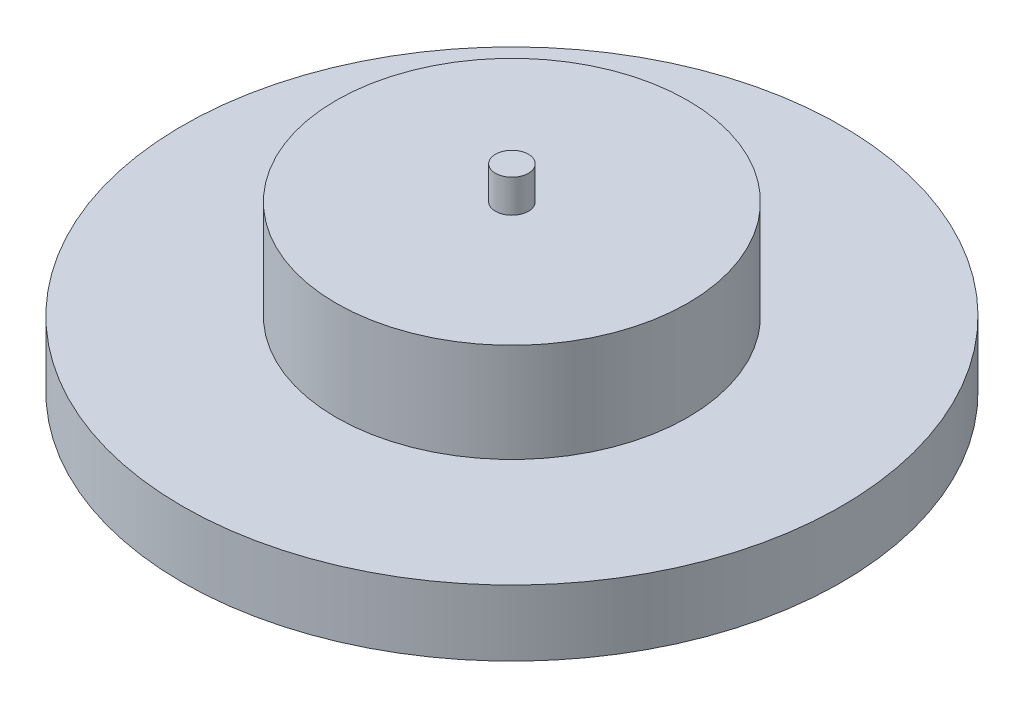
ISO-10303-21;
HEADER;
FILE_DESCRIPTION(('STEP AP214'),'2;1');
FILE_NAME('part.step','',(''),(''),'','','');
FILE_SCHEMA(('AUTOMOTIVE_DESIGN { 1 0 10303 214 1 1 1 1 }'));
ENDSEC;
DATA;
#1=APPLICATION_CONTEXT('core data for automotive mechanical design processes');
#2=APPLICATION_PROTOCOL_DEFINITION('international standard','automotive_design',2000,#1);
#3=PRODUCT_CONTEXT('',#1,'mechanical');
#4=PRODUCT('Part','Part','',(#3));
#5=PRODUCT_RELATED_PRODUCT_CATEGORY('part','',(#4));
#6=PRODUCT_DEFINITION_FORMATION('','',#4);
#7=PRODUCT_DEFINITION_CONTEXT('part definition',#1,'design');
#8=PRODUCT_DEFINITION('design','',#6,#7);
#9=PRODUCT_DEFINITION_SHAPE('','',#8);
#10=(LENGTH_UNIT() NAMED_UNIT(*) SI_UNIT(.MILLI.,.METRE.));
#11=(NAMED_UNIT(*) PLANE_ANGLE_UNIT() SI_UNIT($,.RADIAN.));
#12=(NAMED_UNIT(*) SI_UNIT($,.STERADIAN.) SOLID_ANGLE_UNIT());
#13=UNCERTAINTY_MEASURE_WITH_UNIT(LENGTH_MEASURE(1.E-05),#10,'distance_accuracy_value','');
#14=(GEOMETRIC_REPRESENTATION_CONTEXT(3) GLOBAL_UNCERTAINTY_ASSIGNED_CONTEXT((#13)) GLOBAL_UNIT_ASSIGNED_CONTEXT((#10,
#11,#12)) REPRESENTATION_CONTEXT('',''));
#15=CARTESIAN_POINT('',(0.,0.,0.));
#16=DIRECTION('',(0.,0.,1.));
#17=DIRECTION('',(1.,0.,0.));
#18=AXIS2_PLACEMENT_3D('',#15,#16,#17);
#19=CARTESIAN_POINT('',(0.,3.,0.));
#20=DIRECTION('',(0.,-1.,0.));
#21=DIRECTION('',(0.,0.,-1.));
#22=AXIS2_PLACEMENT_3D('',#19,#20,#21);
#23=CYLINDRICAL_SURFACE('',#22,15.);
#24=CARTESIAN_POINT('',(0.,3.,0.));
#25=DIRECTION('',(0.,1.,0.));
#26=DIRECTION('',(0.,0.,1.));
#27=AXIS2_PLACEMENT_3D('',#24,#25,#26);
#28=CIRCLE('',#27,15.);
#29=CARTESIAN_POINT('',(0.,3.,15.));
#30=VERTEX_POINT('',#29);
#31=EDGE_CURVE('E46',#30,#30,#28,.T.);
#32=ORIENTED_EDGE('',*,*,#31,.F.);
#33=EDGE_LOOP('',(#32));
#34=FACE_BOUND('',#33,.T.);
#35=CARTESIAN_POINT('',(0.,0.,0.));
#36=DIRECTION('',(0.,1.,0.));
#37=DIRECTION('',(0.,0.,1.));
#38=AXIS2_PLACEMENT_3D('',#35,#36,#37);
#39=CIRCLE('',#38,15.);
#40=CARTESIAN_POINT('',(0.,0.,15.));
#41=VERTEX_POINT('',#40);
#42=EDGE_CURVE('E42',#41,#41,#39,.T.);
#43=ORIENTED_EDGE('',*,*,#42,.T.);
#44=EDGE_LOOP('',(#43));
#45=FACE_BOUND('',#44,.T.);
#46=ADVANCED_FACE('F39',(#34,#45),#23,.T.);
#47=CARTESIAN_POINT('',(0.,3.,0.));
#48=DIRECTION('',(0.,1.,0.));
#49=DIRECTION('',(0.,0.,1.));
#50=AXIS2_PLACEMENT_3D('',#47,#48,#49);
#51=PLANE('',#50);
#52=CARTESIAN_POINT('',(0.,3.,0.));
#53=DIRECTION('',(0.,1.,0.));
#54=DIRECTION('',(0.,0.,1.));
#55=AXIS2_PLACEMENT_3D('',#52,#53,#54);
#56=CIRCLE('',#55,8.);
#57=CARTESIAN_POINT('',(0.,3.,8.));
#58=VERTEX_POINT('',#57);
#59=EDGE_CURVE('E10',#58,#58,#56,.T.);
#60=ORIENTED_EDGE('',*,*,#59,.F.);
#61=EDGE_LOOP('',(#60));
#62=FACE_BOUND('',#61,.T.);
#63=ORIENTED_EDGE('',*,*,#31,.T.);
#64=EDGE_LOOP('',(#63));
#65=FACE_BOUND('',#64,.T.);
#66=ADVANCED_FACE('F84',(#62,#65),#51,.T.);
#67=CARTESIAN_POINT('',(0.,0.,0.));
#68=DIRECTION('',(0.,1.,0.));
#69=DIRECTION('',(0.,0.,1.));
#70=AXIS2_PLACEMENT_3D('',#67,#68,#69);
#71=PLANE('',#70);
#72=ORIENTED_EDGE('',*,*,#42,.F.);
#73=EDGE_LOOP('',(#72));
#74=FACE_BOUND('',#73,.T.);
#75=ADVANCED_FACE('F78',(#74),#71,.F.);
#76=CARTESIAN_POINT('',(0.,7.5,0.));
#77=DIRECTION('',(0.,-1.,0.));
#78=DIRECTION('',(0.,0.,-1.));
#79=AXIS2_PLACEMENT_3D('',#76,#77,#78);
#80=CYLINDRICAL_SURFACE('',#79,8.);
#81=CARTESIAN_POINT('',(0.,7.5,0.));
#82=DIRECTION('',(0.,1.,0.));
#83=DIRECTION('',(0.,0.,1.));
#84=AXIS2_PLACEMENT_3D('',#81,#82,#83);
#85=CIRCLE('',#84,8.);
#86=CARTESIAN_POINT('',(0.,7.5,8.));
#87=VERTEX_POINT('',#86);
#88=EDGE_CURVE('E52',#87,#87,#85,.T.);
#89=ORIENTED_EDGE('',*,*,#88,.F.);
#90=EDGE_LOOP('',(#89));
#91=FACE_BOUND('',#90,.T.);
#92=ORIENTED_EDGE('',*,*,#59,.T.);
#93=EDGE_LOOP('',(#92));
#94=FACE_BOUND('',#93,.T.);
#95=ADVANCED_FACE('F73',(#91,#94),#80,.T.);
#96=CARTESIAN_POINT('',(0.,7.5,0.));
#97=DIRECTION('',(0.,1.,0.));
#98=DIRECTION('',(0.,0.,1.));
#99=AXIS2_PLACEMENT_3D('',#96,#97,#98);
#100=PLANE('',#99);
#101=CARTESIAN_POINT('',(0.,7.5,0.));
#102=DIRECTION('',(0.,1.,0.));
#103=DIRECTION('',(0.,0.,1.));
#104=AXIS2_PLACEMENT_3D('',#101,#102,#103);
#105=CIRCLE('',#104,0.75);
#106=CARTESIAN_POINT('',(0.,7.5,0.75));
#107=VERTEX_POINT('',#106);
#108=EDGE_CURVE('E56',#107,#107,#105,.T.);
#109=ORIENTED_EDGE('',*,*,#108,.F.);
#110=EDGE_LOOP('',(#109));
#111=FACE_BOUND('',#110,.T.);
#112=ORIENTED_EDGE('',*,*,#88,.T.);
#113=EDGE_LOOP('',(#112));
#114=FACE_BOUND('',#113,.T.);
#115=ADVANCED_FACE('F67',(#111,#114),#100,.T.);
#116=CARTESIAN_POINT('',(0.,9.,0.));
#117=DIRECTION('',(0.,-1.,0.));
#118=DIRECTION('',(0.,0.,-1.));
#119=AXIS2_PLACEMENT_3D('',#116,#117,#118);
#120=CYLINDRICAL_SURFACE('',#119,0.75);
#121=CARTESIAN_POINT('',(0.,9.,0.));
#122=DIRECTION('',(0.,1.,0.));
#123=DIRECTION('',(0.,0.,1.));
#124=AXIS2_PLACEMENT_3D('',#121,#122,#123);
#125=CIRCLE('',#124,0.75);
#126=CARTESIAN_POINT('',(0.,9.,0.75));
#127=VERTEX_POINT('',#126);
#128=EDGE_CURVE('E55',#127,#127,#125,.T.);
#129=ORIENTED_EDGE('',*,*,#128,.F.);
#130=EDGE_LOOP('',(#129));
#131=FACE_BOUND('',#130,.T.);
#132=ORIENTED_EDGE('',*,*,#108,.T.);
#133=EDGE_LOOP('',(#132));
#134=FACE_BOUND('',#133,.T.);
#135=ADVANCED_FACE('F64',(#131,#134),#120,.T.);
#136=CARTESIAN_POINT('',(0.,9.,0.));
#137=DIRECTION('',(0.,1.,0.));
#138=DIRECTION('',(0.,0.,1.));
#139=AXIS2_PLACEMENT_3D('',#136,#137,#138);
#140=PLANE('',#139);
#141=ORIENTED_EDGE('',*,*,#128,.T.);
#142=EDGE_LOOP('',(#141));
#143=FACE_BOUND('',#142,.T.);
#144=ADVANCED_FACE('F62',(#143),#140,.T.);
#145=CLOSED_SHELL('',(#46,#66,#75,#95,#115,#135,#144));
#146=MANIFOLD_SOLID_BREP('B2',#145);
#147=ADVANCED_BREP_SHAPE_REPRESENTATION('',(#18,#146),#14);
#148=SHAPE_DEFINITION_REPRESENTATION(#9,#147);
ENDSEC;
END-ISO-10303-21;
